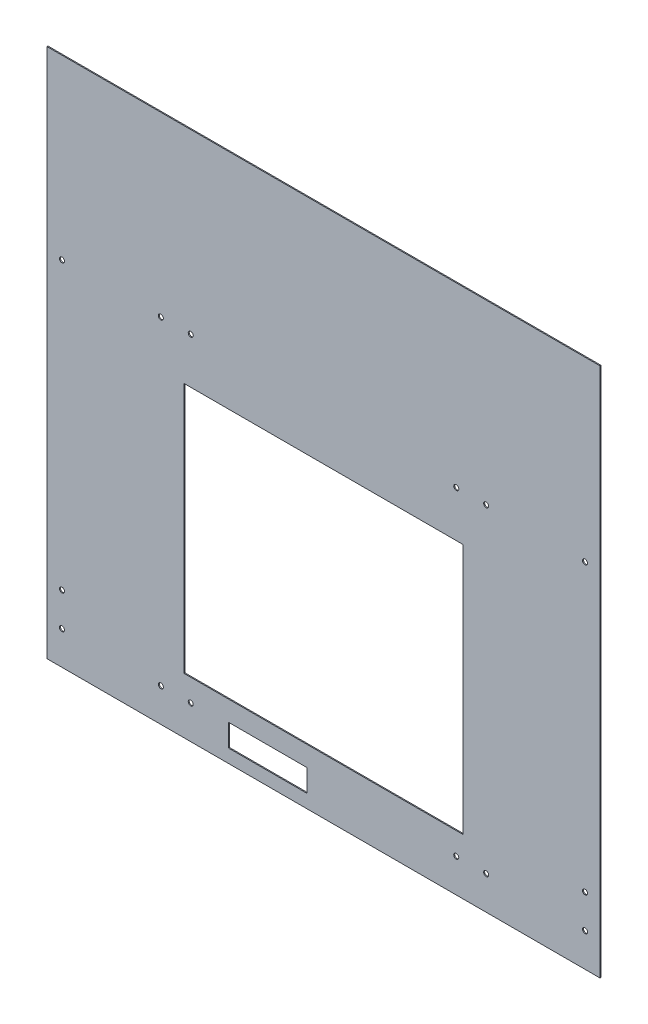
ISO-10303-21;
HEADER;
FILE_DESCRIPTION(('STEP AP214'),'2;1');
FILE_NAME('part.step','',(''),(''),'','','');
FILE_SCHEMA(('AUTOMOTIVE_DESIGN { 1 0 10303 214 1 1 1 1 }'));
ENDSEC;
DATA;
#1=APPLICATION_CONTEXT('core data for automotive mechanical design processes');
#2=APPLICATION_PROTOCOL_DEFINITION('international standard','automotive_design',2000,#1);
#3=PRODUCT_CONTEXT('',#1,'mechanical');
#4=PRODUCT('Part','Part','',(#3));
#5=PRODUCT_RELATED_PRODUCT_CATEGORY('part','',(#4));
#6=PRODUCT_DEFINITION_FORMATION('','',#4);
#7=PRODUCT_DEFINITION_CONTEXT('part definition',#1,'design');
#8=PRODUCT_DEFINITION('design','',#6,#7);
#9=PRODUCT_DEFINITION_SHAPE('','',#8);
#10=(LENGTH_UNIT() NAMED_UNIT(*) SI_UNIT(.MILLI.,.METRE.));
#11=(NAMED_UNIT(*) PLANE_ANGLE_UNIT() SI_UNIT($,.RADIAN.));
#12=(NAMED_UNIT(*) SI_UNIT($,.STERADIAN.) SOLID_ANGLE_UNIT());
#13=UNCERTAINTY_MEASURE_WITH_UNIT(LENGTH_MEASURE(1.E-05),#10,'distance_accuracy_value','');
#14=(GEOMETRIC_REPRESENTATION_CONTEXT(3) GLOBAL_UNCERTAINTY_ASSIGNED_CONTEXT((#13)) GLOBAL_UNIT_ASSIGNED_CONTEXT((#10,
#11,#12)) REPRESENTATION_CONTEXT('',''));
#15=CARTESIAN_POINT('',(0.,0.,0.));
#16=DIRECTION('',(0.,0.,1.));
#17=DIRECTION('',(1.,0.,0.));
#18=AXIS2_PLACEMENT_3D('',#15,#16,#17);
#19=CARTESIAN_POINT('',(-194.960919958,0.,-25.4));
#20=DIRECTION('',(0.,-1.,0.));
#21=DIRECTION('',(0.,0.,-1.));
#22=AXIS2_PLACEMENT_3D('',#19,#20,#21);
#23=PLANE('',#22);
#24=DIRECTION('',(1.,0.,0.));
#25=VECTOR('',#24,1.);
#26=CARTESIAN_POINT('',(170.449919958,0.,0.));
#27=LINE('',#26,#25);
#28=CARTESIAN_POINT('',(-247.74992769133,0.,0.));
#29=VERTEX_POINT('',#28);
#30=CARTESIAN_POINT('',(247.74992769133,0.,0.));
#31=VERTEX_POINT('',#30);
#32=EDGE_CURVE('E50',#29,#31,#27,.T.);
#33=ORIENTED_EDGE('',*,*,#32,.F.);
#34=DIRECTION('',(0.,0.,-1.));
#35=VECTOR('',#34,1.);
#36=CARTESIAN_POINT('',(-247.74992769133,0.,0.));
#37=LINE('',#36,#35);
#38=CARTESIAN_POINT('',(-247.74992769133,0.,-0.888999999999946));
#39=VERTEX_POINT('',#38);
#40=EDGE_CURVE('E172',#29,#39,#37,.T.);
#41=ORIENTED_EDGE('',*,*,#40,.T.);
#42=DIRECTION('',(1.,0.,0.));
#43=VECTOR('',#42,1.);
#44=CARTESIAN_POINT('',(170.449919958,0.,-0.889));
#45=LINE('',#44,#43);
#46=CARTESIAN_POINT('',(247.74992769133,0.,-0.888999999999973));
#47=VERTEX_POINT('',#46);
#48=EDGE_CURVE('E291',#39,#47,#45,.T.);
#49=ORIENTED_EDGE('',*,*,#48,.T.);
#50=DIRECTION('',(0.,0.,1.));
#51=VECTOR('',#50,1.);
#52=CARTESIAN_POINT('',(247.74992769133,0.,-0.888999999999973));
#53=LINE('',#52,#51);
#54=EDGE_CURVE('E188',#47,#31,#53,.T.);
#55=ORIENTED_EDGE('',*,*,#54,.T.);
#56=EDGE_LOOP('',(#33,#41,#49,#55));
#57=FACE_BOUND('',#56,.T.);
#58=ADVANCED_FACE('F46',(#57),#23,.T.);
#59=CARTESIAN_POINT('',(194.960919958,475.,-25.4));
#60=DIRECTION('',(0.,1.,0.));
#61=DIRECTION('',(0.,0.,1.));
#62=AXIS2_PLACEMENT_3D('',#59,#60,#61);
#63=PLANE('',#62);
#64=DIRECTION('',(1.,0.,0.));
#65=VECTOR('',#64,1.);
#66=CARTESIAN_POINT('',(170.449919958,475.,0.));
#67=LINE('',#66,#65);
#68=CARTESIAN_POINT('',(-247.74992769133,475.,0.));
#69=VERTEX_POINT('',#68);
#70=CARTESIAN_POINT('',(247.74992769133,475.,0.));
#71=VERTEX_POINT('',#70);
#72=EDGE_CURVE('E12',#69,#71,#67,.T.);
#73=ORIENTED_EDGE('',*,*,#72,.T.);
#74=DIRECTION('',(0.,0.,1.));
#75=VECTOR('',#74,1.);
#76=CARTESIAN_POINT('',(247.74992769133,475.,-0.888999999999973));
#77=LINE('',#76,#75);
#78=CARTESIAN_POINT('',(247.74992769133,475.,-0.888999999999973));
#79=VERTEX_POINT('',#78);
#80=EDGE_CURVE('E139',#79,#71,#77,.T.);
#81=ORIENTED_EDGE('',*,*,#80,.F.);
#82=DIRECTION('',(1.,0.,0.));
#83=VECTOR('',#82,1.);
#84=CARTESIAN_POINT('',(170.449919958,475.,-0.889));
#85=LINE('',#84,#83);
#86=CARTESIAN_POINT('',(-247.74992769133,475.,-0.888999999999946));
#87=VERTEX_POINT('',#86);
#88=EDGE_CURVE('E55',#87,#79,#85,.T.);
#89=ORIENTED_EDGE('',*,*,#88,.F.);
#90=DIRECTION('',(0.,0.,-1.));
#91=VECTOR('',#90,1.);
#92=CARTESIAN_POINT('',(-247.74992769133,475.,0.));
#93=LINE('',#92,#91);
#94=EDGE_CURVE('E141',#69,#87,#93,.T.);
#95=ORIENTED_EDGE('',*,*,#94,.F.);
#96=EDGE_LOOP('',(#73,#81,#89,#95));
#97=FACE_BOUND('',#96,.T.);
#98=ADVANCED_FACE('F137',(#97),#63,.T.);
#99=CARTESIAN_POINT('',(170.449919958,475.,-0.889));
#100=DIRECTION('',(0.,0.,-1.));
#101=DIRECTION('',(-1.,0.,0.));
#102=AXIS2_PLACEMENT_3D('',#99,#100,#101);
#103=PLANE('',#102);
#104=DIRECTION('',(0.,1.,0.));
#105=VECTOR('',#104,1.);
#106=CARTESIAN_POINT('',(-15.,12.,-0.889));
#107=LINE('',#106,#105);
#108=CARTESIAN_POINT('',(-15.,12.,-0.889));
#109=VERTEX_POINT('',#108);
#110=CARTESIAN_POINT('',(-15.,32.,-0.889));
#111=VERTEX_POINT('',#110);
#112=EDGE_CURVE('E189',#109,#111,#107,.T.);
#113=ORIENTED_EDGE('',*,*,#112,.T.);
#114=DIRECTION('',(-1.,0.,0.));
#115=VECTOR('',#114,1.);
#116=CARTESIAN_POINT('',(-15.,32.,-0.889));
#117=LINE('',#116,#115);
#118=CARTESIAN_POINT('',(-85.,32.,-0.888999999999969));
#119=VERTEX_POINT('',#118);
#120=EDGE_CURVE('E192',#111,#119,#117,.T.);
#121=ORIENTED_EDGE('',*,*,#120,.T.);
#122=DIRECTION('',(0.,-1.,0.));
#123=VECTOR('',#122,1.);
#124=CARTESIAN_POINT('',(-85.,12.,-0.889));
#125=LINE('',#124,#123);
#126=CARTESIAN_POINT('',(-85.,12.,-0.889));
#127=VERTEX_POINT('',#126);
#128=EDGE_CURVE('E63',#119,#127,#125,.T.);
#129=ORIENTED_EDGE('',*,*,#128,.T.);
#130=DIRECTION('',(1.,0.,0.));
#131=VECTOR('',#130,1.);
#132=CARTESIAN_POINT('',(-15.,12.,-0.889));
#133=LINE('',#132,#131);
#134=EDGE_CURVE('E197',#127,#109,#133,.T.);
#135=ORIENTED_EDGE('',*,*,#134,.T.);
#136=EDGE_LOOP('',(#113,#121,#129,#135));
#137=FACE_BOUND('',#136,.T.);
#138=CARTESIAN_POINT('',(-145.753813013,30.,-0.889));
#139=DIRECTION('',(0.,0.,1.));
#140=DIRECTION('',(1.,0.,0.));
#141=AXIS2_PLACEMENT_3D('',#138,#139,#140);
#142=CIRCLE('',#141,2.25000000000001);
#143=CARTESIAN_POINT('',(-143.503813013,30.,-0.889));
#144=VERTEX_POINT('',#143);
#145=EDGE_CURVE('E218',#144,#144,#142,.T.);
#146=ORIENTED_EDGE('',*,*,#145,.T.);
#147=EDGE_LOOP('',(#146));
#148=FACE_BOUND('',#147,.T.);
#149=CARTESIAN_POINT('',(-118.946026903,30.,-0.889));
#150=DIRECTION('',(0.,0.,1.));
#151=DIRECTION('',(1.,0.,0.));
#152=AXIS2_PLACEMENT_3D('',#149,#150,#151);
#153=CIRCLE('',#152,2.25);
#154=CARTESIAN_POINT('',(-116.696026903,30.,-0.889));
#155=VERTEX_POINT('',#154);
#156=EDGE_CURVE('E224',#155,#155,#153,.T.);
#157=ORIENTED_EDGE('',*,*,#156,.T.);
#158=EDGE_LOOP('',(#157));
#159=FACE_BOUND('',#158,.T.);
#160=CARTESIAN_POINT('',(118.946026903,30.,-0.889));
#161=DIRECTION('',(0.,0.,1.));
#162=DIRECTION('',(1.,0.,0.));
#163=AXIS2_PLACEMENT_3D('',#160,#161,#162);
#164=CIRCLE('',#163,2.25);
#165=CARTESIAN_POINT('',(121.196026903,30.,-0.889));
#166=VERTEX_POINT('',#165);
#167=EDGE_CURVE('E230',#166,#166,#164,.T.);
#168=ORIENTED_EDGE('',*,*,#167,.T.);
#169=EDGE_LOOP('',(#168));
#170=FACE_BOUND('',#169,.T.);
#171=CARTESIAN_POINT('',(145.753813013,30.,-0.889));
#172=DIRECTION('',(0.,0.,1.));
#173=DIRECTION('',(1.,0.,0.));
#174=AXIS2_PLACEMENT_3D('',#171,#172,#173);
#175=CIRCLE('',#174,2.25000000000001);
#176=CARTESIAN_POINT('',(148.003813013,30.,-0.889));
#177=VERTEX_POINT('',#176);
#178=EDGE_CURVE('E236',#177,#177,#175,.T.);
#179=ORIENTED_EDGE('',*,*,#178,.T.);
#180=EDGE_LOOP('',(#179));
#181=FACE_BOUND('',#180,.T.);
#182=CARTESIAN_POINT('',(145.753813013,316.132839976,-0.889));
#183=DIRECTION('',(0.,0.,1.));
#184=DIRECTION('',(1.,0.,0.));
#185=AXIS2_PLACEMENT_3D('',#182,#183,#184);
#186=CIRCLE('',#185,2.25000000000001);
#187=CARTESIAN_POINT('',(148.003813013,316.132839976,-0.889));
#188=VERTEX_POINT('',#187);
#189=EDGE_CURVE('E242',#188,#188,#186,.T.);
#190=ORIENTED_EDGE('',*,*,#189,.T.);
#191=EDGE_LOOP('',(#190));
#192=FACE_BOUND('',#191,.T.);
#193=CARTESIAN_POINT('',(118.946026903,316.132839976,-0.889));
#194=DIRECTION('',(0.,0.,1.));
#195=DIRECTION('',(1.,0.,0.));
#196=AXIS2_PLACEMENT_3D('',#193,#194,#195);
#197=CIRCLE('',#196,2.25);
#198=CARTESIAN_POINT('',(121.196026903,316.132839976,-0.889));
#199=VERTEX_POINT('',#198);
#200=EDGE_CURVE('E248',#199,#199,#197,.T.);
#201=ORIENTED_EDGE('',*,*,#200,.T.);
#202=EDGE_LOOP('',(#201));
#203=FACE_BOUND('',#202,.T.);
#204=CARTESIAN_POINT('',(-118.946026903,316.132839976,-0.889));
#205=DIRECTION('',(0.,0.,1.));
#206=DIRECTION('',(1.,0.,0.));
#207=AXIS2_PLACEMENT_3D('',#204,#205,#206);
#208=CIRCLE('',#207,2.25);
#209=CARTESIAN_POINT('',(-116.696026903,316.132839976,-0.889));
#210=VERTEX_POINT('',#209);
#211=EDGE_CURVE('E254',#210,#210,#208,.T.);
#212=ORIENTED_EDGE('',*,*,#211,.T.);
#213=EDGE_LOOP('',(#212));
#214=FACE_BOUND('',#213,.T.);
#215=CARTESIAN_POINT('',(-145.753813013,316.132839976,-0.889));
#216=DIRECTION('',(0.,0.,1.));
#217=DIRECTION('',(1.,0.,0.));
#218=AXIS2_PLACEMENT_3D('',#215,#216,#217);
#219=CIRCLE('',#218,2.25000000000001);
#220=CARTESIAN_POINT('',(-143.503813013,316.132839976,-0.889));
#221=VERTEX_POINT('',#220);
#222=EDGE_CURVE('E260',#221,#221,#219,.T.);
#223=ORIENTED_EDGE('',*,*,#222,.T.);
#224=EDGE_LOOP('',(#223));
#225=FACE_BOUND('',#224,.T.);
#226=DIRECTION('',(0.,-1.,0.));
#227=VECTOR('',#226,1.);
#228=CARTESIAN_POINT('',(-125.,275.,-0.889));
#229=LINE('',#228,#227);
#230=CARTESIAN_POINT('',(-125.,275.,-0.889));
#231=VERTEX_POINT('',#230);
#232=CARTESIAN_POINT('',(-125.,50.,-0.889));
#233=VERTEX_POINT('',#232);
#234=EDGE_CURVE('E266',#231,#233,#229,.T.);
#235=ORIENTED_EDGE('',*,*,#234,.T.);
#236=DIRECTION('',(1.,0.,0.));
#237=VECTOR('',#236,1.);
#238=CARTESIAN_POINT('',(-125.,50.,-0.889));
#239=LINE('',#238,#237);
#240=CARTESIAN_POINT('',(125.,50.,-0.888999999999995));
#241=VERTEX_POINT('',#240);
#242=EDGE_CURVE('E269',#233,#241,#239,.T.);
#243=ORIENTED_EDGE('',*,*,#242,.T.);
#244=DIRECTION('',(0.,1.,0.));
#245=VECTOR('',#244,1.);
#246=CARTESIAN_POINT('',(125.,275.,-0.889));
#247=LINE('',#246,#245);
#248=CARTESIAN_POINT('',(125.,275.,-0.889));
#249=VERTEX_POINT('',#248);
#250=EDGE_CURVE('E273',#241,#249,#247,.T.);
#251=ORIENTED_EDGE('',*,*,#250,.T.);
#252=DIRECTION('',(-1.,0.,0.));
#253=VECTOR('',#252,1.);
#254=CARTESIAN_POINT('',(-125.,275.,-0.889));
#255=LINE('',#254,#253);
#256=EDGE_CURVE('E276',#249,#231,#255,.T.);
#257=ORIENTED_EDGE('',*,*,#256,.T.);
#258=EDGE_LOOP('',(#235,#243,#251,#257));
#259=FACE_BOUND('',#258,.T.);
#260=ORIENTED_EDGE('',*,*,#48,.F.);
#261=DIRECTION('',(0.,-1.,0.));
#262=VECTOR('',#261,1.);
#263=CARTESIAN_POINT('',(-247.74992769133,475.,-0.888999999999946));
#264=LINE('',#263,#262);
#265=EDGE_CURVE('E184',#87,#39,#264,.T.);
#266=ORIENTED_EDGE('',*,*,#265,.F.);
#267=ORIENTED_EDGE('',*,*,#88,.T.);
#268=DIRECTION('',(0.,-1.,0.));
#269=VECTOR('',#268,1.);
#270=CARTESIAN_POINT('',(247.74992769133,475.,-0.888999999999973));
#271=LINE('',#270,#269);
#272=EDGE_CURVE('E157',#79,#47,#271,.T.);
#273=ORIENTED_EDGE('',*,*,#272,.T.);
#274=EDGE_LOOP('',(#260,#266,#267,#273));
#275=FACE_BOUND('',#274,.T.);
#276=CARTESIAN_POINT('',(-234.34603469133,30.,-0.888999999999946));
#277=DIRECTION('',(0.,0.,-1.));
#278=DIRECTION('',(-1.,0.,0.));
#279=AXIS2_PLACEMENT_3D('',#276,#277,#278);
#280=CIRCLE('',#279,2.25);
#281=CARTESIAN_POINT('',(-236.59603469133,30.,-0.888999999999946));
#282=VERTEX_POINT('',#281);
#283=EDGE_CURVE('E175',#282,#282,#280,.T.);
#284=ORIENTED_EDGE('',*,*,#283,.F.);
#285=EDGE_LOOP('',(#284));
#286=FACE_BOUND('',#285,.T.);
#287=CARTESIAN_POINT('',(-234.34603469133,316.132840032,-0.888999999999946));
#288=DIRECTION('',(0.,0.,-1.));
#289=DIRECTION('',(-1.,0.,0.));
#290=AXIS2_PLACEMENT_3D('',#287,#288,#289);
#291=CIRCLE('',#290,2.25);
#292=CARTESIAN_POINT('',(-236.59603469133,316.132840032,-0.888999999999946));
#293=VERTEX_POINT('',#292);
#294=EDGE_CURVE('E178',#293,#293,#291,.T.);
#295=ORIENTED_EDGE('',*,*,#294,.F.);
#296=EDGE_LOOP('',(#295));
#297=FACE_BOUND('',#296,.T.);
#298=CARTESIAN_POINT('',(-234.34603469133,60.,-0.888999999999946));
#299=DIRECTION('',(0.,0.,-1.));
#300=DIRECTION('',(-1.,0.,0.));
#301=AXIS2_PLACEMENT_3D('',#298,#299,#300);
#302=CIRCLE('',#301,2.25);
#303=CARTESIAN_POINT('',(-236.59603469133,60.,-0.888999999999946));
#304=VERTEX_POINT('',#303);
#305=EDGE_CURVE('E181',#304,#304,#302,.T.);
#306=ORIENTED_EDGE('',*,*,#305,.F.);
#307=EDGE_LOOP('',(#306));
#308=FACE_BOUND('',#307,.T.);
#309=CARTESIAN_POINT('',(234.34603469133,30.,-0.889000000000001));
#310=DIRECTION('',(0.,0.,-1.));
#311=DIRECTION('',(-1.,0.,0.));
#312=AXIS2_PLACEMENT_3D('',#309,#310,#311);
#313=CIRCLE('',#312,2.25);
#314=CARTESIAN_POINT('',(232.09603469133,30.,-0.889000000000002));
#315=VERTEX_POINT('',#314);
#316=EDGE_CURVE('E309',#315,#315,#313,.T.);
#317=ORIENTED_EDGE('',*,*,#316,.F.);
#318=EDGE_LOOP('',(#317));
#319=FACE_BOUND('',#318,.T.);
#320=CARTESIAN_POINT('',(234.34603469133,316.132840032,-0.889000000000001));
#321=DIRECTION('',(0.,0.,-1.));
#322=DIRECTION('',(-1.,0.,0.));
#323=AXIS2_PLACEMENT_3D('',#320,#321,#322);
#324=CIRCLE('',#323,2.25);
#325=CARTESIAN_POINT('',(232.09603469133,316.132840032,-0.889000000000002));
#326=VERTEX_POINT('',#325);
#327=EDGE_CURVE('E315',#326,#326,#324,.T.);
#328=ORIENTED_EDGE('',*,*,#327,.F.);
#329=EDGE_LOOP('',(#328));
#330=FACE_BOUND('',#329,.T.);
#331=CARTESIAN_POINT('',(234.34603469133,60.,-0.889000000000001));
#332=DIRECTION('',(0.,0.,-1.));
#333=DIRECTION('',(-1.,0.,0.));
#334=AXIS2_PLACEMENT_3D('',#331,#332,#333);
#335=CIRCLE('',#334,2.25);
#336=CARTESIAN_POINT('',(232.09603469133,60.,-0.889000000000002));
#337=VERTEX_POINT('',#336);
#338=EDGE_CURVE('E152',#337,#337,#335,.T.);
#339=ORIENTED_EDGE('',*,*,#338,.F.);
#340=EDGE_LOOP('',(#339));
#341=FACE_BOUND('',#340,.T.);
#342=ADVANCED_FACE('F48',(#137,#148,#159,#170,#181,#192,#203,#214,#225,#259,#275,#286,#297,#308,
#319,#330,#341),#103,.T.);
#343=CARTESIAN_POINT('',(170.449919958,475.,0.));
#344=DIRECTION('',(0.,0.,-1.));
#345=DIRECTION('',(-1.,0.,0.));
#346=AXIS2_PLACEMENT_3D('',#343,#344,#345);
#347=PLANE('',#346);
#348=DIRECTION('',(-1.,0.,0.));
#349=VECTOR('',#348,1.);
#350=CARTESIAN_POINT('',(-15.,32.,0.));
#351=LINE('',#350,#349);
#352=CARTESIAN_POINT('',(-15.,32.,0.));
#353=VERTEX_POINT('',#352);
#354=CARTESIAN_POINT('',(-85.,32.,0.));
#355=VERTEX_POINT('',#354);
#356=EDGE_CURVE('E202',#353,#355,#351,.T.);
#357=ORIENTED_EDGE('',*,*,#356,.F.);
#358=DIRECTION('',(0.,1.,0.));
#359=VECTOR('',#358,1.);
#360=CARTESIAN_POINT('',(-15.,12.,0.));
#361=LINE('',#360,#359);
#362=CARTESIAN_POINT('',(-15.,12.,0.));
#363=VERTEX_POINT('',#362);
#364=EDGE_CURVE('E71',#363,#353,#361,.T.);
#365=ORIENTED_EDGE('',*,*,#364,.F.);
#366=DIRECTION('',(1.,0.,0.));
#367=VECTOR('',#366,1.);
#368=CARTESIAN_POINT('',(-15.,12.,0.));
#369=LINE('',#368,#367);
#370=CARTESIAN_POINT('',(-85.,12.,0.));
#371=VERTEX_POINT('',#370);
#372=EDGE_CURVE('E193',#371,#363,#369,.T.);
#373=ORIENTED_EDGE('',*,*,#372,.F.);
#374=DIRECTION('',(0.,-1.,0.));
#375=VECTOR('',#374,1.);
#376=CARTESIAN_POINT('',(-85.,12.,0.));
#377=LINE('',#376,#375);
#378=EDGE_CURVE('E205',#355,#371,#377,.T.);
#379=ORIENTED_EDGE('',*,*,#378,.F.);
#380=EDGE_LOOP('',(#357,#365,#373,#379));
#381=FACE_BOUND('',#380,.T.);
#382=CARTESIAN_POINT('',(-145.753813013,30.,0.));
#383=DIRECTION('',(0.,0.,1.));
#384=DIRECTION('',(1.,0.,0.));
#385=AXIS2_PLACEMENT_3D('',#382,#383,#384);
#386=CIRCLE('',#385,2.25000000000001);
#387=CARTESIAN_POINT('',(-143.503813013,30.,0.));
#388=VERTEX_POINT('',#387);
#389=EDGE_CURVE('E212',#388,#388,#386,.T.);
#390=ORIENTED_EDGE('',*,*,#389,.F.);
#391=EDGE_LOOP('',(#390));
#392=FACE_BOUND('',#391,.T.);
#393=CARTESIAN_POINT('',(-118.946026903,30.,0.));
#394=DIRECTION('',(0.,0.,1.));
#395=DIRECTION('',(1.,0.,0.));
#396=AXIS2_PLACEMENT_3D('',#393,#394,#395);
#397=CIRCLE('',#396,2.25);
#398=CARTESIAN_POINT('',(-116.696026903,30.,0.));
#399=VERTEX_POINT('',#398);
#400=EDGE_CURVE('E221',#399,#399,#397,.T.);
#401=ORIENTED_EDGE('',*,*,#400,.F.);
#402=EDGE_LOOP('',(#401));
#403=FACE_BOUND('',#402,.T.);
#404=CARTESIAN_POINT('',(118.946026903,30.,0.));
#405=DIRECTION('',(0.,0.,1.));
#406=DIRECTION('',(1.,0.,0.));
#407=AXIS2_PLACEMENT_3D('',#404,#405,#406);
#408=CIRCLE('',#407,2.25);
#409=CARTESIAN_POINT('',(121.196026903,30.,0.));
#410=VERTEX_POINT('',#409);
#411=EDGE_CURVE('E227',#410,#410,#408,.T.);
#412=ORIENTED_EDGE('',*,*,#411,.F.);
#413=EDGE_LOOP('',(#412));
#414=FACE_BOUND('',#413,.T.);
#415=CARTESIAN_POINT('',(145.753813013,30.,0.));
#416=DIRECTION('',(0.,0.,1.));
#417=DIRECTION('',(1.,0.,0.));
#418=AXIS2_PLACEMENT_3D('',#415,#416,#417);
#419=CIRCLE('',#418,2.25000000000001);
#420=CARTESIAN_POINT('',(148.003813013,30.,0.));
#421=VERTEX_POINT('',#420);
#422=EDGE_CURVE('E233',#421,#421,#419,.T.);
#423=ORIENTED_EDGE('',*,*,#422,.F.);
#424=EDGE_LOOP('',(#423));
#425=FACE_BOUND('',#424,.T.);
#426=CARTESIAN_POINT('',(145.753813013,316.132839976,0.));
#427=DIRECTION('',(0.,0.,1.));
#428=DIRECTION('',(1.,0.,0.));
#429=AXIS2_PLACEMENT_3D('',#426,#427,#428);
#430=CIRCLE('',#429,2.25000000000001);
#431=CARTESIAN_POINT('',(148.003813013,316.132839976,0.));
#432=VERTEX_POINT('',#431);
#433=EDGE_CURVE('E239',#432,#432,#430,.T.);
#434=ORIENTED_EDGE('',*,*,#433,.F.);
#435=EDGE_LOOP('',(#434));
#436=FACE_BOUND('',#435,.T.);
#437=CARTESIAN_POINT('',(118.946026903,316.132839976,0.));
#438=DIRECTION('',(0.,0.,1.));
#439=DIRECTION('',(1.,0.,0.));
#440=AXIS2_PLACEMENT_3D('',#437,#438,#439);
#441=CIRCLE('',#440,2.25);
#442=CARTESIAN_POINT('',(121.196026903,316.132839976,0.));
#443=VERTEX_POINT('',#442);
#444=EDGE_CURVE('E245',#443,#443,#441,.T.);
#445=ORIENTED_EDGE('',*,*,#444,.F.);
#446=EDGE_LOOP('',(#445));
#447=FACE_BOUND('',#446,.T.);
#448=CARTESIAN_POINT('',(-118.946026903,316.132839976,0.));
#449=DIRECTION('',(0.,0.,1.));
#450=DIRECTION('',(1.,0.,0.));
#451=AXIS2_PLACEMENT_3D('',#448,#449,#450);
#452=CIRCLE('',#451,2.25);
#453=CARTESIAN_POINT('',(-116.696026903,316.132839976,0.));
#454=VERTEX_POINT('',#453);
#455=EDGE_CURVE('E251',#454,#454,#452,.T.);
#456=ORIENTED_EDGE('',*,*,#455,.F.);
#457=EDGE_LOOP('',(#456));
#458=FACE_BOUND('',#457,.T.);
#459=CARTESIAN_POINT('',(-145.753813013,316.132839976,0.));
#460=DIRECTION('',(0.,0.,1.));
#461=DIRECTION('',(1.,0.,0.));
#462=AXIS2_PLACEMENT_3D('',#459,#460,#461);
#463=CIRCLE('',#462,2.25000000000001);
#464=CARTESIAN_POINT('',(-143.503813013,316.132839976,0.));
#465=VERTEX_POINT('',#464);
#466=EDGE_CURVE('E257',#465,#465,#463,.T.);
#467=ORIENTED_EDGE('',*,*,#466,.F.);
#468=EDGE_LOOP('',(#467));
#469=FACE_BOUND('',#468,.T.);
#470=DIRECTION('',(1.,0.,0.));
#471=VECTOR('',#470,1.);
#472=CARTESIAN_POINT('',(-125.,50.,0.));
#473=LINE('',#472,#471);
#474=CARTESIAN_POINT('',(-125.,50.,0.));
#475=VERTEX_POINT('',#474);
#476=CARTESIAN_POINT('',(125.,50.0000000000001,0.));
#477=VERTEX_POINT('',#476);
#478=EDGE_CURVE('E281',#475,#477,#473,.T.);
#479=ORIENTED_EDGE('',*,*,#478,.F.);
#480=DIRECTION('',(0.,-1.,0.));
#481=VECTOR('',#480,1.);
#482=CARTESIAN_POINT('',(-125.,275.,0.));
#483=LINE('',#482,#481);
#484=CARTESIAN_POINT('',(-125.,275.,0.));
#485=VERTEX_POINT('',#484);
#486=EDGE_CURVE('E263',#485,#475,#483,.T.);
#487=ORIENTED_EDGE('',*,*,#486,.F.);
#488=DIRECTION('',(-1.,0.,0.));
#489=VECTOR('',#488,1.);
#490=CARTESIAN_POINT('',(-125.,275.,0.));
#491=LINE('',#490,#489);
#492=CARTESIAN_POINT('',(125.,275.,0.));
#493=VERTEX_POINT('',#492);
#494=EDGE_CURVE('E270',#493,#485,#491,.T.);
#495=ORIENTED_EDGE('',*,*,#494,.F.);
#496=DIRECTION('',(0.,1.,0.));
#497=VECTOR('',#496,1.);
#498=CARTESIAN_POINT('',(125.,275.,0.));
#499=LINE('',#498,#497);
#500=EDGE_CURVE('E284',#477,#493,#499,.T.);
#501=ORIENTED_EDGE('',*,*,#500,.F.);
#502=EDGE_LOOP('',(#479,#487,#495,#501));
#503=FACE_BOUND('',#502,.T.);
#504=ORIENTED_EDGE('',*,*,#32,.T.);
#505=DIRECTION('',(0.,-1.,0.));
#506=VECTOR('',#505,1.);
#507=CARTESIAN_POINT('',(247.74992769133,475.,0.));
#508=LINE('',#507,#506);
#509=EDGE_CURVE('E146',#71,#31,#508,.T.);
#510=ORIENTED_EDGE('',*,*,#509,.F.);
#511=ORIENTED_EDGE('',*,*,#72,.F.);
#512=DIRECTION('',(0.,-1.,0.));
#513=VECTOR('',#512,1.);
#514=CARTESIAN_POINT('',(-247.74992769133,475.,0.));
#515=LINE('',#514,#513);
#516=EDGE_CURVE('E161',#69,#29,#515,.T.);
#517=ORIENTED_EDGE('',*,*,#516,.T.);
#518=EDGE_LOOP('',(#504,#510,#511,#517));
#519=FACE_BOUND('',#518,.T.);
#520=CARTESIAN_POINT('',(-234.34603469133,30.,0.));
#521=DIRECTION('',(0.,0.,-1.));
#522=DIRECTION('',(-1.,0.,0.));
#523=AXIS2_PLACEMENT_3D('',#520,#521,#522);
#524=CIRCLE('',#523,2.25);
#525=CARTESIAN_POINT('',(-236.59603469133,30.,0.));
#526=VERTEX_POINT('',#525);
#527=EDGE_CURVE('E169',#526,#526,#524,.T.);
#528=ORIENTED_EDGE('',*,*,#527,.T.);
#529=EDGE_LOOP('',(#528));
#530=FACE_BOUND('',#529,.T.);
#531=CARTESIAN_POINT('',(-234.34603469133,316.132840032,0.));
#532=DIRECTION('',(0.,0.,-1.));
#533=DIRECTION('',(-1.,0.,0.));
#534=AXIS2_PLACEMENT_3D('',#531,#532,#533);
#535=CIRCLE('',#534,2.25);
#536=CARTESIAN_POINT('',(-236.59603469133,316.132840032,0.));
#537=VERTEX_POINT('',#536);
#538=EDGE_CURVE('E166',#537,#537,#535,.T.);
#539=ORIENTED_EDGE('',*,*,#538,.T.);
#540=EDGE_LOOP('',(#539));
#541=FACE_BOUND('',#540,.T.);
#542=CARTESIAN_POINT('',(-234.34603469133,60.,0.));
#543=DIRECTION('',(0.,0.,-1.));
#544=DIRECTION('',(-1.,0.,0.));
#545=AXIS2_PLACEMENT_3D('',#542,#543,#544);
#546=CIRCLE('',#545,2.25);
#547=CARTESIAN_POINT('',(-236.59603469133,60.,0.));
#548=VERTEX_POINT('',#547);
#549=EDGE_CURVE('E163',#548,#548,#546,.T.);
#550=ORIENTED_EDGE('',*,*,#549,.T.);
#551=EDGE_LOOP('',(#550));
#552=FACE_BOUND('',#551,.T.);
#553=CARTESIAN_POINT('',(234.34603469133,30.,0.));
#554=DIRECTION('',(0.,0.,1.));
#555=DIRECTION('',(1.,0.,0.));
#556=AXIS2_PLACEMENT_3D('',#553,#554,#555);
#557=CIRCLE('',#556,2.25);
#558=CARTESIAN_POINT('',(236.59603469133,30.,0.));
#559=VERTEX_POINT('',#558);
#560=EDGE_CURVE('E303',#559,#559,#557,.T.);
#561=ORIENTED_EDGE('',*,*,#560,.F.);
#562=EDGE_LOOP('',(#561));
#563=FACE_BOUND('',#562,.T.);
#564=CARTESIAN_POINT('',(234.34603469133,316.132840032,0.));
#565=DIRECTION('',(0.,0.,1.));
#566=DIRECTION('',(1.,0.,0.));
#567=AXIS2_PLACEMENT_3D('',#564,#565,#566);
#568=CIRCLE('',#567,2.25);
#569=CARTESIAN_POINT('',(236.59603469133,316.132840032,0.));
#570=VERTEX_POINT('',#569);
#571=EDGE_CURVE('E312',#570,#570,#568,.T.);
#572=ORIENTED_EDGE('',*,*,#571,.F.);
#573=EDGE_LOOP('',(#572));
#574=FACE_BOUND('',#573,.T.);
#575=CARTESIAN_POINT('',(234.34603469133,60.,0.));
#576=DIRECTION('',(0.,0.,1.));
#577=DIRECTION('',(1.,0.,0.));
#578=AXIS2_PLACEMENT_3D('',#575,#576,#577);
#579=CIRCLE('',#578,2.25);
#580=CARTESIAN_POINT('',(236.59603469133,60.,0.));
#581=VERTEX_POINT('',#580);
#582=EDGE_CURVE('E318',#581,#581,#579,.T.);
#583=ORIENTED_EDGE('',*,*,#582,.F.);
#584=EDGE_LOOP('',(#583));
#585=FACE_BOUND('',#584,.T.);
#586=ADVANCED_FACE('F147',(#381,#392,#403,#414,#425,#436,#447,#458,#469,#503,#519,#530,#541,
#552,#563,#574,#585),#347,.F.);
#587=CARTESIAN_POINT('',(-125.,275.,-0.889));
#588=DIRECTION('',(-1.,0.,0.));
#589=DIRECTION('',(0.,-1.,0.));
#590=AXIS2_PLACEMENT_3D('',#587,#588,#589);
#591=PLANE('',#590);
#592=ORIENTED_EDGE('',*,*,#486,.T.);
#593=DIRECTION('',(0.,0.,1.));
#594=VECTOR('',#593,1.);
#595=CARTESIAN_POINT('',(-125.,50.,-0.889));
#596=LINE('',#595,#594);
#597=EDGE_CURVE('E279',#233,#475,#596,.T.);
#598=ORIENTED_EDGE('',*,*,#597,.F.);
#599=ORIENTED_EDGE('',*,*,#234,.F.);
#600=DIRECTION('',(0.,0.,1.));
#601=VECTOR('',#600,1.);
#602=CARTESIAN_POINT('',(-125.,275.,-0.889));
#603=LINE('',#602,#601);
#604=EDGE_CURVE('E289',#231,#485,#603,.T.);
#605=ORIENTED_EDGE('',*,*,#604,.T.);
#606=EDGE_LOOP('',(#592,#598,#599,#605));
#607=FACE_BOUND('',#606,.T.);
#608=ADVANCED_FACE('F332',(#607),#591,.F.);
#609=CARTESIAN_POINT('',(-125.,275.,-0.889));
#610=DIRECTION('',(0.,1.,0.));
#611=DIRECTION('',(0.,0.,1.));
#612=AXIS2_PLACEMENT_3D('',#609,#610,#611);
#613=PLANE('',#612);
#614=ORIENTED_EDGE('',*,*,#494,.T.);
#615=ORIENTED_EDGE('',*,*,#604,.F.);
#616=ORIENTED_EDGE('',*,*,#256,.F.);
#617=DIRECTION('',(0.,0.,1.));
#618=VECTOR('',#617,1.);
#619=CARTESIAN_POINT('',(125.,275.,-0.889));
#620=LINE('',#619,#618);
#621=EDGE_CURVE('E292',#249,#493,#620,.T.);
#622=ORIENTED_EDGE('',*,*,#621,.T.);
#623=EDGE_LOOP('',(#614,#615,#616,#622));
#624=FACE_BOUND('',#623,.T.);
#625=ADVANCED_FACE('F343',(#624),#613,.F.);
#626=CARTESIAN_POINT('',(125.,275.,-0.889));
#627=DIRECTION('',(1.,0.,0.));
#628=DIRECTION('',(0.,0.,-1.));
#629=AXIS2_PLACEMENT_3D('',#626,#627,#628);
#630=PLANE('',#629);
#631=ORIENTED_EDGE('',*,*,#500,.T.);
#632=ORIENTED_EDGE('',*,*,#621,.F.);
#633=ORIENTED_EDGE('',*,*,#250,.F.);
#634=DIRECTION('',(0.,0.,1.));
#635=VECTOR('',#634,1.);
#636=CARTESIAN_POINT('',(125.,50.0000000000001,-0.889));
#637=LINE('',#636,#635);
#638=EDGE_CURVE('E294',#241,#477,#637,.T.);
#639=ORIENTED_EDGE('',*,*,#638,.T.);
#640=EDGE_LOOP('',(#631,#632,#633,#639));
#641=FACE_BOUND('',#640,.T.);
#642=ADVANCED_FACE('F349',(#641),#630,.F.);
#643=CARTESIAN_POINT('',(-125.,50.,-0.889));
#644=DIRECTION('',(0.,-1.,0.));
#645=DIRECTION('',(1.,0.,0.));
#646=AXIS2_PLACEMENT_3D('',#643,#644,#645);
#647=PLANE('',#646);
#648=ORIENTED_EDGE('',*,*,#478,.T.);
#649=ORIENTED_EDGE('',*,*,#638,.F.);
#650=ORIENTED_EDGE('',*,*,#242,.F.);
#651=ORIENTED_EDGE('',*,*,#597,.T.);
#652=EDGE_LOOP('',(#648,#649,#650,#651));
#653=FACE_BOUND('',#652,.T.);
#654=ADVANCED_FACE('F345',(#653),#647,.F.);
#655=CARTESIAN_POINT('',(-145.753813013,316.132839976,-0.889));
#656=DIRECTION('',(0.,0.,1.));
#657=DIRECTION('',(1.,0.,0.));
#658=AXIS2_PLACEMENT_3D('',#655,#656,#657);
#659=CYLINDRICAL_SURFACE('',#658,2.25000000000001);
#660=ORIENTED_EDGE('',*,*,#222,.F.);
#661=EDGE_LOOP('',(#660));
#662=FACE_BOUND('',#661,.T.);
#663=ORIENTED_EDGE('',*,*,#466,.T.);
#664=EDGE_LOOP('',(#663));
#665=FACE_BOUND('',#664,.T.);
#666=ADVANCED_FACE('F348',(#662,#665),#659,.F.);
#667=CARTESIAN_POINT('',(-118.946026903,316.132839976,-0.889));
#668=DIRECTION('',(0.,0.,1.));
#669=DIRECTION('',(1.,0.,0.));
#670=AXIS2_PLACEMENT_3D('',#667,#668,#669);
#671=CYLINDRICAL_SURFACE('',#670,2.25);
#672=ORIENTED_EDGE('',*,*,#211,.F.);
#673=EDGE_LOOP('',(#672));
#674=FACE_BOUND('',#673,.T.);
#675=ORIENTED_EDGE('',*,*,#455,.T.);
#676=EDGE_LOOP('',(#675));
#677=FACE_BOUND('',#676,.T.);
#678=ADVANCED_FACE('F359',(#674,#677),#671,.F.);
#679=CARTESIAN_POINT('',(118.946026903,316.132839976,-0.889));
#680=DIRECTION('',(0.,0.,1.));
#681=DIRECTION('',(1.,0.,0.));
#682=AXIS2_PLACEMENT_3D('',#679,#680,#681);
#683=CYLINDRICAL_SURFACE('',#682,2.25);
#684=ORIENTED_EDGE('',*,*,#200,.F.);
#685=EDGE_LOOP('',(#684));
#686=FACE_BOUND('',#685,.T.);
#687=ORIENTED_EDGE('',*,*,#444,.T.);
#688=EDGE_LOOP('',(#687));
#689=FACE_BOUND('',#688,.T.);
#690=ADVANCED_FACE('F363',(#686,#689),#683,.F.);
#691=CARTESIAN_POINT('',(145.753813013,316.132839976,-0.889));
#692=DIRECTION('',(0.,0.,1.));
#693=DIRECTION('',(1.,0.,0.));
#694=AXIS2_PLACEMENT_3D('',#691,#692,#693);
#695=CYLINDRICAL_SURFACE('',#694,2.25000000000001);
#696=ORIENTED_EDGE('',*,*,#189,.F.);
#697=EDGE_LOOP('',(#696));
#698=FACE_BOUND('',#697,.T.);
#699=ORIENTED_EDGE('',*,*,#433,.T.);
#700=EDGE_LOOP('',(#699));
#701=FACE_BOUND('',#700,.T.);
#702=ADVANCED_FACE('F367',(#698,#701),#695,.F.);
#703=CARTESIAN_POINT('',(145.753813013,30.,-0.889));
#704=DIRECTION('',(0.,0.,1.));
#705=DIRECTION('',(1.,0.,0.));
#706=AXIS2_PLACEMENT_3D('',#703,#704,#705);
#707=CYLINDRICAL_SURFACE('',#706,2.25000000000001);
#708=ORIENTED_EDGE('',*,*,#178,.F.);
#709=EDGE_LOOP('',(#708));
#710=FACE_BOUND('',#709,.T.);
#711=ORIENTED_EDGE('',*,*,#422,.T.);
#712=EDGE_LOOP('',(#711));
#713=FACE_BOUND('',#712,.T.);
#714=ADVANCED_FACE('F371',(#710,#713),#707,.F.);
#715=CARTESIAN_POINT('',(118.946026903,30.,-0.889));
#716=DIRECTION('',(0.,0.,1.));
#717=DIRECTION('',(1.,0.,0.));
#718=AXIS2_PLACEMENT_3D('',#715,#716,#717);
#719=CYLINDRICAL_SURFACE('',#718,2.25);
#720=ORIENTED_EDGE('',*,*,#167,.F.);
#721=EDGE_LOOP('',(#720));
#722=FACE_BOUND('',#721,.T.);
#723=ORIENTED_EDGE('',*,*,#411,.T.);
#724=EDGE_LOOP('',(#723));
#725=FACE_BOUND('',#724,.T.);
#726=ADVANCED_FACE('F375',(#722,#725),#719,.F.);
#727=CARTESIAN_POINT('',(-118.946026903,30.,-0.889));
#728=DIRECTION('',(0.,0.,1.));
#729=DIRECTION('',(1.,0.,0.));
#730=AXIS2_PLACEMENT_3D('',#727,#728,#729);
#731=CYLINDRICAL_SURFACE('',#730,2.25);
#732=ORIENTED_EDGE('',*,*,#156,.F.);
#733=EDGE_LOOP('',(#732));
#734=FACE_BOUND('',#733,.T.);
#735=ORIENTED_EDGE('',*,*,#400,.T.);
#736=EDGE_LOOP('',(#735));
#737=FACE_BOUND('',#736,.T.);
#738=ADVANCED_FACE('F379',(#734,#737),#731,.F.);
#739=CARTESIAN_POINT('',(-145.753813013,30.,-0.889));
#740=DIRECTION('',(0.,0.,1.));
#741=DIRECTION('',(1.,0.,0.));
#742=AXIS2_PLACEMENT_3D('',#739,#740,#741);
#743=CYLINDRICAL_SURFACE('',#742,2.25000000000001);
#744=ORIENTED_EDGE('',*,*,#145,.F.);
#745=EDGE_LOOP('',(#744));
#746=FACE_BOUND('',#745,.T.);
#747=ORIENTED_EDGE('',*,*,#389,.T.);
#748=EDGE_LOOP('',(#747));
#749=FACE_BOUND('',#748,.T.);
#750=ADVANCED_FACE('F383',(#746,#749),#743,.F.);
#751=CARTESIAN_POINT('',(-15.,12.,-0.889));
#752=DIRECTION('',(1.,0.,0.));
#753=DIRECTION('',(0.,0.,-1.));
#754=AXIS2_PLACEMENT_3D('',#751,#752,#753);
#755=PLANE('',#754);
#756=ORIENTED_EDGE('',*,*,#364,.T.);
#757=DIRECTION('',(0.,0.,1.));
#758=VECTOR('',#757,1.);
#759=CARTESIAN_POINT('',(-15.,32.,-0.889));
#760=LINE('',#759,#758);
#761=EDGE_CURVE('E200',#111,#353,#760,.T.);
#762=ORIENTED_EDGE('',*,*,#761,.F.);
#763=ORIENTED_EDGE('',*,*,#112,.F.);
#764=DIRECTION('',(0.,0.,1.));
#765=VECTOR('',#764,1.);
#766=CARTESIAN_POINT('',(-15.,12.,-0.889));
#767=LINE('',#766,#765);
#768=EDGE_CURVE('E210',#109,#363,#767,.T.);
#769=ORIENTED_EDGE('',*,*,#768,.T.);
#770=EDGE_LOOP('',(#756,#762,#763,#769));
#771=FACE_BOUND('',#770,.T.);
#772=ADVANCED_FACE('F387',(#771),#755,.F.);
#773=CARTESIAN_POINT('',(-15.,12.,-0.889));
#774=DIRECTION('',(0.,-1.,0.));
#775=DIRECTION('',(1.,0.,0.));
#776=AXIS2_PLACEMENT_3D('',#773,#774,#775);
#777=PLANE('',#776);
#778=ORIENTED_EDGE('',*,*,#372,.T.);
#779=ORIENTED_EDGE('',*,*,#768,.F.);
#780=ORIENTED_EDGE('',*,*,#134,.F.);
#781=DIRECTION('',(0.,0.,1.));
#782=VECTOR('',#781,1.);
#783=CARTESIAN_POINT('',(-85.,12.,-0.889));
#784=LINE('',#783,#782);
#785=EDGE_CURVE('E213',#127,#371,#784,.T.);
#786=ORIENTED_EDGE('',*,*,#785,.T.);
#787=EDGE_LOOP('',(#778,#779,#780,#786));
#788=FACE_BOUND('',#787,.T.);
#789=ADVANCED_FACE('F391',(#788),#777,.F.);
#790=CARTESIAN_POINT('',(-85.,12.,-0.889));
#791=DIRECTION('',(-1.,0.,0.));
#792=DIRECTION('',(0.,0.,1.));
#793=AXIS2_PLACEMENT_3D('',#790,#791,#792);
#794=PLANE('',#793);
#795=ORIENTED_EDGE('',*,*,#378,.T.);
#796=ORIENTED_EDGE('',*,*,#785,.F.);
#797=ORIENTED_EDGE('',*,*,#128,.F.);
#798=DIRECTION('',(0.,0.,1.));
#799=VECTOR('',#798,1.);
#800=CARTESIAN_POINT('',(-85.,32.,-0.889));
#801=LINE('',#800,#799);
#802=EDGE_CURVE('E215',#119,#355,#801,.T.);
#803=ORIENTED_EDGE('',*,*,#802,.T.);
#804=EDGE_LOOP('',(#795,#796,#797,#803));
#805=FACE_BOUND('',#804,.T.);
#806=ADVANCED_FACE('F396',(#805),#794,.F.);
#807=CARTESIAN_POINT('',(-15.,32.,-0.889));
#808=DIRECTION('',(0.,1.,0.));
#809=DIRECTION('',(0.,0.,1.));
#810=AXIS2_PLACEMENT_3D('',#807,#808,#809);
#811=PLANE('',#810);
#812=ORIENTED_EDGE('',*,*,#356,.T.);
#813=ORIENTED_EDGE('',*,*,#802,.F.);
#814=ORIENTED_EDGE('',*,*,#120,.F.);
#815=ORIENTED_EDGE('',*,*,#761,.T.);
#816=EDGE_LOOP('',(#812,#813,#814,#815));
#817=FACE_BOUND('',#816,.T.);
#818=ADVANCED_FACE('F392',(#817),#811,.F.);
#819=CARTESIAN_POINT('',(-247.74992769133,475.,0.));
#820=DIRECTION('',(-1.,0.,0.));
#821=DIRECTION('',(0.,0.,1.));
#822=AXIS2_PLACEMENT_3D('',#819,#820,#821);
#823=PLANE('',#822);
#824=ORIENTED_EDGE('',*,*,#40,.F.);
#825=ORIENTED_EDGE('',*,*,#516,.F.);
#826=ORIENTED_EDGE('',*,*,#94,.T.);
#827=ORIENTED_EDGE('',*,*,#265,.T.);
#828=EDGE_LOOP('',(#824,#825,#826,#827));
#829=FACE_BOUND('',#828,.T.);
#830=ADVANCED_FACE('F395',(#829),#823,.T.);
#831=CARTESIAN_POINT('',(-234.34603469133,60.,0.));
#832=DIRECTION('',(0.,0.,-1.));
#833=DIRECTION('',(-1.,0.,0.));
#834=AXIS2_PLACEMENT_3D('',#831,#832,#833);
#835=CYLINDRICAL_SURFACE('',#834,2.25);
#836=ORIENTED_EDGE('',*,*,#305,.T.);
#837=EDGE_LOOP('',(#836));
#838=FACE_BOUND('',#837,.T.);
#839=ORIENTED_EDGE('',*,*,#549,.F.);
#840=EDGE_LOOP('',(#839));
#841=FACE_BOUND('',#840,.T.);
#842=ADVANCED_FACE('F410',(#838,#841),#835,.F.);
#843=CARTESIAN_POINT('',(-234.34603469133,316.132840032,0.));
#844=DIRECTION('',(0.,0.,-1.));
#845=DIRECTION('',(-1.,0.,0.));
#846=AXIS2_PLACEMENT_3D('',#843,#844,#845);
#847=CYLINDRICAL_SURFACE('',#846,2.25);
#848=ORIENTED_EDGE('',*,*,#294,.T.);
#849=EDGE_LOOP('',(#848));
#850=FACE_BOUND('',#849,.T.);
#851=ORIENTED_EDGE('',*,*,#538,.F.);
#852=EDGE_LOOP('',(#851));
#853=FACE_BOUND('',#852,.T.);
#854=ADVANCED_FACE('F406',(#850,#853),#847,.F.);
#855=CARTESIAN_POINT('',(-234.34603469133,30.,0.));
#856=DIRECTION('',(0.,0.,-1.));
#857=DIRECTION('',(-1.,0.,0.));
#858=AXIS2_PLACEMENT_3D('',#855,#856,#857);
#859=CYLINDRICAL_SURFACE('',#858,2.25);
#860=ORIENTED_EDGE('',*,*,#283,.T.);
#861=EDGE_LOOP('',(#860));
#862=FACE_BOUND('',#861,.T.);
#863=ORIENTED_EDGE('',*,*,#527,.F.);
#864=EDGE_LOOP('',(#863));
#865=FACE_BOUND('',#864,.T.);
#866=ADVANCED_FACE('F403',(#862,#865),#859,.F.);
#867=CARTESIAN_POINT('',(247.74992769133,475.,-0.888999999999973));
#868=DIRECTION('',(1.,0.,0.));
#869=DIRECTION('',(0.,0.,-1.));
#870=AXIS2_PLACEMENT_3D('',#867,#868,#869);
#871=PLANE('',#870);
#872=ORIENTED_EDGE('',*,*,#54,.F.);
#873=ORIENTED_EDGE('',*,*,#272,.F.);
#874=ORIENTED_EDGE('',*,*,#80,.T.);
#875=ORIENTED_EDGE('',*,*,#509,.T.);
#876=EDGE_LOOP('',(#872,#873,#874,#875));
#877=FACE_BOUND('',#876,.T.);
#878=ADVANCED_FACE('F155',(#877),#871,.T.);
#879=CARTESIAN_POINT('',(234.34603469133,60.,-391.699839916));
#880=DIRECTION('',(0.,0.,1.));
#881=DIRECTION('',(1.,0.,0.));
#882=AXIS2_PLACEMENT_3D('',#879,#880,#881);
#883=CYLINDRICAL_SURFACE('',#882,2.25);
#884=ORIENTED_EDGE('',*,*,#338,.T.);
#885=EDGE_LOOP('',(#884));
#886=FACE_BOUND('',#885,.T.);
#887=ORIENTED_EDGE('',*,*,#582,.T.);
#888=EDGE_LOOP('',(#887));
#889=FACE_BOUND('',#888,.T.);
#890=ADVANCED_FACE('F323',(#886,#889),#883,.F.);
#891=CARTESIAN_POINT('',(234.34603469133,316.132840032,-391.699839916));
#892=DIRECTION('',(0.,0.,1.));
#893=DIRECTION('',(1.,0.,0.));
#894=AXIS2_PLACEMENT_3D('',#891,#892,#893);
#895=CYLINDRICAL_SURFACE('',#894,2.25);
#896=ORIENTED_EDGE('',*,*,#327,.T.);
#897=EDGE_LOOP('',(#896));
#898=FACE_BOUND('',#897,.T.);
#899=ORIENTED_EDGE('',*,*,#571,.T.);
#900=EDGE_LOOP('',(#899));
#901=FACE_BOUND('',#900,.T.);
#902=ADVANCED_FACE('F421',(#898,#901),#895,.F.);
#903=CARTESIAN_POINT('',(234.34603469133,30.,-391.699839916));
#904=DIRECTION('',(0.,0.,1.));
#905=DIRECTION('',(1.,0.,0.));
#906=AXIS2_PLACEMENT_3D('',#903,#904,#905);
#907=CYLINDRICAL_SURFACE('',#906,2.25);
#908=ORIENTED_EDGE('',*,*,#316,.T.);
#909=EDGE_LOOP('',(#908));
#910=FACE_BOUND('',#909,.T.);
#911=ORIENTED_EDGE('',*,*,#560,.T.);
#912=EDGE_LOOP('',(#911));
#913=FACE_BOUND('',#912,.T.);
#914=ADVANCED_FACE('F418',(#910,#913),#907,.F.);
#915=CLOSED_SHELL('',(#58,#98,#342,#586,#608,#625,#642,#654,#666,#678,#690,#702,#714,#726,#738,
#750,#772,#789,#806,#818,#830,#842,#854,#866,#878,#890,#902,#914));
#916=MANIFOLD_SOLID_BREP('B2',#915);
#917=ADVANCED_BREP_SHAPE_REPRESENTATION('',(#18,#916),#14);
#918=SHAPE_DEFINITION_REPRESENTATION(#9,#917);
ENDSEC;
END-ISO-10303-21;
